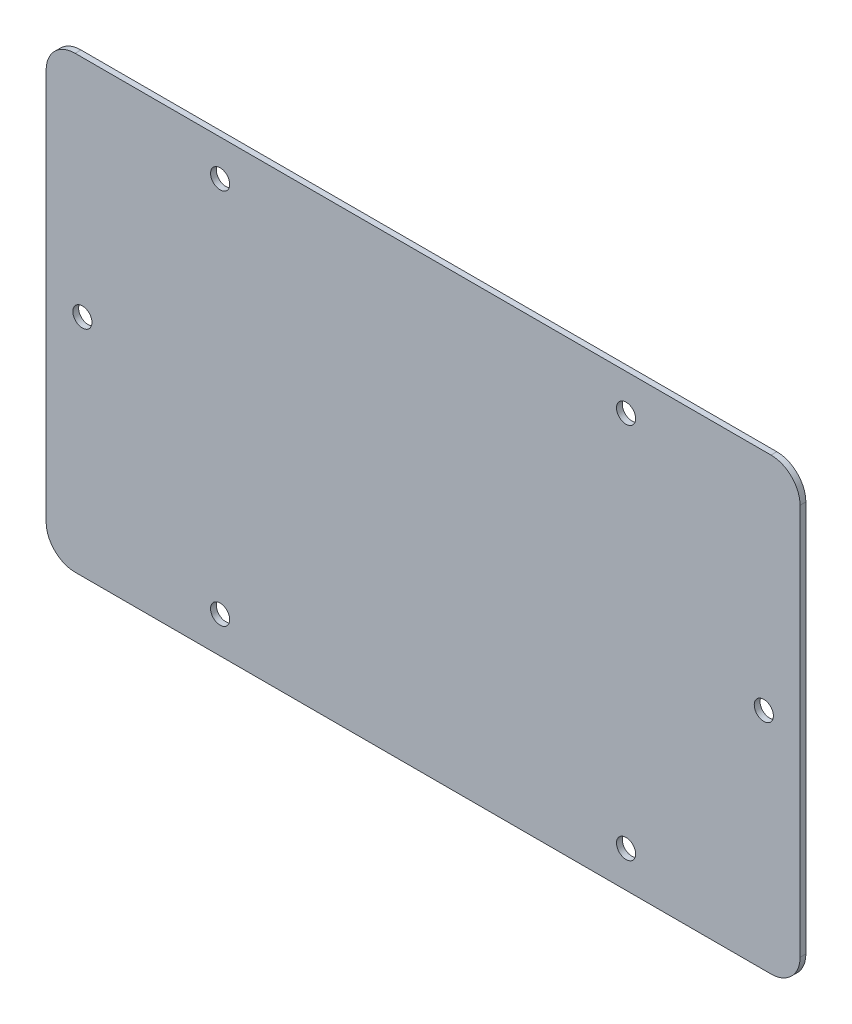
ISO-10303-21;
HEADER;
FILE_DESCRIPTION(('STEP AP214'),'2;1');
FILE_NAME('part.step','',(''),(''),'','','');
FILE_SCHEMA(('AUTOMOTIVE_DESIGN { 1 0 10303 214 1 1 1 1 }'));
ENDSEC;
DATA;
#1=APPLICATION_CONTEXT('core data for automotive mechanical design processes');
#2=APPLICATION_PROTOCOL_DEFINITION('international standard','automotive_design',2000,#1);
#3=PRODUCT_CONTEXT('',#1,'mechanical');
#4=PRODUCT('Part','Part','',(#3));
#5=PRODUCT_RELATED_PRODUCT_CATEGORY('part','',(#4));
#6=PRODUCT_DEFINITION_FORMATION('','',#4);
#7=PRODUCT_DEFINITION_CONTEXT('part definition',#1,'design');
#8=PRODUCT_DEFINITION('design','',#6,#7);
#9=PRODUCT_DEFINITION_SHAPE('','',#8);
#10=(LENGTH_UNIT() NAMED_UNIT(*) SI_UNIT(.MILLI.,.METRE.));
#11=(NAMED_UNIT(*) PLANE_ANGLE_UNIT() SI_UNIT($,.RADIAN.));
#12=(NAMED_UNIT(*) SI_UNIT($,.STERADIAN.) SOLID_ANGLE_UNIT());
#13=UNCERTAINTY_MEASURE_WITH_UNIT(LENGTH_MEASURE(1.E-05),#10,'distance_accuracy_value','');
#14=(GEOMETRIC_REPRESENTATION_CONTEXT(3) GLOBAL_UNCERTAINTY_ASSIGNED_CONTEXT((#13)) GLOBAL_UNIT_ASSIGNED_CONTEXT((#10,
#11,#12)) REPRESENTATION_CONTEXT('',''));
#15=CARTESIAN_POINT('',(0.,0.,0.));
#16=DIRECTION('',(0.,0.,1.));
#17=DIRECTION('',(1.,0.,0.));
#18=AXIS2_PLACEMENT_3D('',#15,#16,#17);
#19=CARTESIAN_POINT('',(-130.,77.5,0.));
#20=DIRECTION('',(0.,-1.,0.));
#21=DIRECTION('',(-1.,0.,0.));
#22=AXIS2_PLACEMENT_3D('',#19,#20,#21);
#23=PLANE('',#22);
#24=DIRECTION('',(0.,0.,1.));
#25=VECTOR('',#24,1.);
#26=CARTESIAN_POINT('',(120.,77.5,0.));
#27=LINE('',#26,#25);
#28=CARTESIAN_POINT('',(120.,77.5,-2.));
#29=VERTEX_POINT('',#28);
#30=CARTESIAN_POINT('',(120.,77.5,0.));
#31=VERTEX_POINT('',#30);
#32=EDGE_CURVE('E11',#29,#31,#27,.T.);
#33=ORIENTED_EDGE('',*,*,#32,.F.);
#34=DIRECTION('',(-1.,0.,0.));
#35=VECTOR('',#34,1.);
#36=CARTESIAN_POINT('',(0.,77.5,-2.));
#37=LINE('',#36,#35);
#38=CARTESIAN_POINT('',(-120.,77.5,-2.));
#39=VERTEX_POINT('',#38);
#40=EDGE_CURVE('E104',#29,#39,#37,.T.);
#41=ORIENTED_EDGE('',*,*,#40,.T.);
#42=DIRECTION('',(0.,0.,1.));
#43=VECTOR('',#42,1.);
#44=CARTESIAN_POINT('',(-120.,77.5,0.));
#45=LINE('',#44,#43);
#46=CARTESIAN_POINT('',(-120.,77.5,0.));
#47=VERTEX_POINT('',#46);
#48=EDGE_CURVE('E47',#39,#47,#45,.T.);
#49=ORIENTED_EDGE('',*,*,#48,.T.);
#50=DIRECTION('',(-1.,0.,0.));
#51=VECTOR('',#50,1.);
#52=CARTESIAN_POINT('',(-130.,77.5,0.));
#53=LINE('',#52,#51);
#54=EDGE_CURVE('E146',#31,#47,#53,.T.);
#55=ORIENTED_EDGE('',*,*,#54,.F.);
#56=EDGE_LOOP('',(#33,#41,#49,#55));
#57=FACE_BOUND('',#56,.T.);
#58=ADVANCED_FACE('F37',(#57),#23,.F.);
#59=CARTESIAN_POINT('',(-120.,67.5,0.));
#60=DIRECTION('',(0.,0.,-1.));
#61=DIRECTION('',(-1.,0.,0.));
#62=AXIS2_PLACEMENT_3D('',#59,#60,#61);
#63=CYLINDRICAL_SURFACE('',#62,10.);
#64=ORIENTED_EDGE('',*,*,#48,.F.);
#65=CARTESIAN_POINT('',(-120.,67.5,-2.));
#66=DIRECTION('',(0.,0.,-1.));
#67=DIRECTION('',(-1.,0.,0.));
#68=AXIS2_PLACEMENT_3D('',#65,#66,#67);
#69=CIRCLE('',#68,10.);
#70=CARTESIAN_POINT('',(-130.,67.5,-2.));
#71=VERTEX_POINT('',#70);
#72=EDGE_CURVE('E126',#39,#71,#69,.F.);
#73=ORIENTED_EDGE('',*,*,#72,.T.);
#74=DIRECTION('',(0.,0.,1.));
#75=VECTOR('',#74,1.);
#76=CARTESIAN_POINT('',(-130.,67.5,0.));
#77=LINE('',#76,#75);
#78=CARTESIAN_POINT('',(-130.,67.5,0.));
#79=VERTEX_POINT('',#78);
#80=EDGE_CURVE('E139',#71,#79,#77,.T.);
#81=ORIENTED_EDGE('',*,*,#80,.T.);
#82=CARTESIAN_POINT('',(-120.,67.5,0.));
#83=DIRECTION('',(0.,0.,-1.));
#84=DIRECTION('',(-1.,0.,0.));
#85=AXIS2_PLACEMENT_3D('',#82,#83,#84);
#86=CIRCLE('',#85,10.);
#87=EDGE_CURVE('E155',#47,#79,#86,.F.);
#88=ORIENTED_EDGE('',*,*,#87,.F.);
#89=EDGE_LOOP('',(#64,#73,#81,#88));
#90=FACE_BOUND('',#89,.T.);
#91=ADVANCED_FACE('F158',(#90),#63,.T.);
#92=CARTESIAN_POINT('',(-130.,-77.5000000000001,0.));
#93=DIRECTION('',(1.,0.,0.));
#94=DIRECTION('',(0.,-1.,0.));
#95=AXIS2_PLACEMENT_3D('',#92,#93,#94);
#96=PLANE('',#95);
#97=ORIENTED_EDGE('',*,*,#80,.F.);
#98=DIRECTION('',(0.,1.,0.));
#99=VECTOR('',#98,1.);
#100=CARTESIAN_POINT('',(-130.,0.,-2.));
#101=LINE('',#100,#99);
#102=CARTESIAN_POINT('',(-130.,-67.5000000000001,-2.));
#103=VERTEX_POINT('',#102);
#104=EDGE_CURVE('E123',#71,#103,#101,.F.);
#105=ORIENTED_EDGE('',*,*,#104,.T.);
#106=DIRECTION('',(0.,0.,1.));
#107=VECTOR('',#106,1.);
#108=CARTESIAN_POINT('',(-130.,-67.5000000000001,0.));
#109=LINE('',#108,#107);
#110=CARTESIAN_POINT('',(-130.,-67.5000000000001,0.));
#111=VERTEX_POINT('',#110);
#112=EDGE_CURVE('E136',#103,#111,#109,.T.);
#113=ORIENTED_EDGE('',*,*,#112,.T.);
#114=DIRECTION('',(0.,-1.,0.));
#115=VECTOR('',#114,1.);
#116=CARTESIAN_POINT('',(-130.,-77.5000000000001,0.));
#117=LINE('',#116,#115);
#118=EDGE_CURVE('E159',#79,#111,#117,.T.);
#119=ORIENTED_EDGE('',*,*,#118,.F.);
#120=EDGE_LOOP('',(#97,#105,#113,#119));
#121=FACE_BOUND('',#120,.T.);
#122=ADVANCED_FACE('F212',(#121),#96,.F.);
#123=CARTESIAN_POINT('',(-120.,-67.5000000000001,0.));
#124=DIRECTION('',(0.,0.,-1.));
#125=DIRECTION('',(-1.,0.,0.));
#126=AXIS2_PLACEMENT_3D('',#123,#124,#125);
#127=CYLINDRICAL_SURFACE('',#126,10.);
#128=ORIENTED_EDGE('',*,*,#112,.F.);
#129=CARTESIAN_POINT('',(-120.,-67.5000000000001,-2.));
#130=DIRECTION('',(0.,0.,-1.));
#131=DIRECTION('',(-1.,0.,0.));
#132=AXIS2_PLACEMENT_3D('',#129,#130,#131);
#133=CIRCLE('',#132,10.);
#134=CARTESIAN_POINT('',(-120.,-77.5000000000001,-2.));
#135=VERTEX_POINT('',#134);
#136=EDGE_CURVE('E120',#103,#135,#133,.F.);
#137=ORIENTED_EDGE('',*,*,#136,.T.);
#138=DIRECTION('',(0.,0.,1.));
#139=VECTOR('',#138,1.);
#140=CARTESIAN_POINT('',(-120.,-77.5000000000001,0.));
#141=LINE('',#140,#139);
#142=CARTESIAN_POINT('',(-120.,-77.5000000000001,0.));
#143=VERTEX_POINT('',#142);
#144=EDGE_CURVE('E133',#135,#143,#141,.T.);
#145=ORIENTED_EDGE('',*,*,#144,.T.);
#146=CARTESIAN_POINT('',(-120.,-67.5000000000001,0.));
#147=DIRECTION('',(0.,0.,-1.));
#148=DIRECTION('',(-1.,0.,0.));
#149=AXIS2_PLACEMENT_3D('',#146,#147,#148);
#150=CIRCLE('',#149,10.);
#151=EDGE_CURVE('E161',#111,#143,#150,.F.);
#152=ORIENTED_EDGE('',*,*,#151,.F.);
#153=EDGE_LOOP('',(#128,#137,#145,#152));
#154=FACE_BOUND('',#153,.T.);
#155=ADVANCED_FACE('F217',(#154),#127,.T.);
#156=CARTESIAN_POINT('',(-130.,-77.5000000000001,0.));
#157=DIRECTION('',(0.,1.,0.));
#158=DIRECTION('',(1.,0.,0.));
#159=AXIS2_PLACEMENT_3D('',#156,#157,#158);
#160=PLANE('',#159);
#161=ORIENTED_EDGE('',*,*,#144,.F.);
#162=DIRECTION('',(-1.,0.,0.));
#163=VECTOR('',#162,1.);
#164=CARTESIAN_POINT('',(0.,-77.5000000000001,-2.));
#165=LINE('',#164,#163);
#166=CARTESIAN_POINT('',(120.,-77.5000000000001,-2.));
#167=VERTEX_POINT('',#166);
#168=EDGE_CURVE('E117',#135,#167,#165,.F.);
#169=ORIENTED_EDGE('',*,*,#168,.T.);
#170=DIRECTION('',(0.,0.,1.));
#171=VECTOR('',#170,1.);
#172=CARTESIAN_POINT('',(120.,-77.5000000000001,0.));
#173=LINE('',#172,#171);
#174=CARTESIAN_POINT('',(120.,-77.5000000000001,0.));
#175=VERTEX_POINT('',#174);
#176=EDGE_CURVE('E131',#167,#175,#173,.T.);
#177=ORIENTED_EDGE('',*,*,#176,.T.);
#178=DIRECTION('',(1.,0.,0.));
#179=VECTOR('',#178,1.);
#180=CARTESIAN_POINT('',(-130.,-77.5000000000001,0.));
#181=LINE('',#180,#179);
#182=EDGE_CURVE('E167',#143,#175,#181,.T.);
#183=ORIENTED_EDGE('',*,*,#182,.F.);
#184=EDGE_LOOP('',(#161,#169,#177,#183));
#185=FACE_BOUND('',#184,.T.);
#186=ADVANCED_FACE('F221',(#185),#160,.F.);
#187=CARTESIAN_POINT('',(120.,-67.5000000000001,0.));
#188=DIRECTION('',(0.,0.,-1.));
#189=DIRECTION('',(-1.,0.,0.));
#190=AXIS2_PLACEMENT_3D('',#187,#188,#189);
#191=CYLINDRICAL_SURFACE('',#190,10.);
#192=ORIENTED_EDGE('',*,*,#176,.F.);
#193=CARTESIAN_POINT('',(120.,-67.5000000000001,-2.));
#194=DIRECTION('',(0.,0.,-1.));
#195=DIRECTION('',(-1.,0.,0.));
#196=AXIS2_PLACEMENT_3D('',#193,#194,#195);
#197=CIRCLE('',#196,10.);
#198=CARTESIAN_POINT('',(130.,-67.5000000000001,-2.));
#199=VERTEX_POINT('',#198);
#200=EDGE_CURVE('E114',#167,#199,#197,.F.);
#201=ORIENTED_EDGE('',*,*,#200,.T.);
#202=DIRECTION('',(0.,0.,1.));
#203=VECTOR('',#202,1.);
#204=CARTESIAN_POINT('',(130.,-67.5000000000001,0.));
#205=LINE('',#204,#203);
#206=CARTESIAN_POINT('',(130.,-67.5000000000001,0.));
#207=VERTEX_POINT('',#206);
#208=EDGE_CURVE('E55',#199,#207,#205,.T.);
#209=ORIENTED_EDGE('',*,*,#208,.T.);
#210=CARTESIAN_POINT('',(120.,-67.5000000000001,0.));
#211=DIRECTION('',(0.,0.,-1.));
#212=DIRECTION('',(-1.,0.,0.));
#213=AXIS2_PLACEMENT_3D('',#210,#211,#212);
#214=CIRCLE('',#213,10.);
#215=EDGE_CURVE('E97',#175,#207,#214,.F.);
#216=ORIENTED_EDGE('',*,*,#215,.F.);
#217=EDGE_LOOP('',(#192,#201,#209,#216));
#218=FACE_BOUND('',#217,.T.);
#219=ADVANCED_FACE('F225',(#218),#191,.T.);
#220=CARTESIAN_POINT('',(130.,-77.5000000000001,0.));
#221=DIRECTION('',(-1.,0.,0.));
#222=DIRECTION('',(0.,1.,0.));
#223=AXIS2_PLACEMENT_3D('',#220,#221,#222);
#224=PLANE('',#223);
#225=ORIENTED_EDGE('',*,*,#208,.F.);
#226=DIRECTION('',(0.,1.,0.));
#227=VECTOR('',#226,1.);
#228=CARTESIAN_POINT('',(130.,0.,-2.));
#229=LINE('',#228,#227);
#230=CARTESIAN_POINT('',(130.,67.5,-2.));
#231=VERTEX_POINT('',#230);
#232=EDGE_CURVE('E102',#199,#231,#229,.T.);
#233=ORIENTED_EDGE('',*,*,#232,.T.);
#234=DIRECTION('',(0.,0.,1.));
#235=VECTOR('',#234,1.);
#236=CARTESIAN_POINT('',(130.,67.5,0.));
#237=LINE('',#236,#235);
#238=CARTESIAN_POINT('',(130.,67.5,0.));
#239=VERTEX_POINT('',#238);
#240=EDGE_CURVE('E41',#231,#239,#237,.T.);
#241=ORIENTED_EDGE('',*,*,#240,.T.);
#242=DIRECTION('',(0.,1.,0.));
#243=VECTOR('',#242,1.);
#244=CARTESIAN_POINT('',(130.,-77.5000000000001,0.));
#245=LINE('',#244,#243);
#246=EDGE_CURVE('E273',#207,#239,#245,.T.);
#247=ORIENTED_EDGE('',*,*,#246,.F.);
#248=EDGE_LOOP('',(#225,#233,#241,#247));
#249=FACE_BOUND('',#248,.T.);
#250=ADVANCED_FACE('F106',(#249),#224,.F.);
#251=CARTESIAN_POINT('',(70.0000000000001,65.,0.));
#252=DIRECTION('',(0.,0.,-1.));
#253=DIRECTION('',(-1.,0.,0.));
#254=AXIS2_PLACEMENT_3D('',#251,#252,#253);
#255=CYLINDRICAL_SURFACE('',#254,3.3);
#256=CARTESIAN_POINT('',(70.0000000000001,65.,0.));
#257=DIRECTION('',(0.,0.,-1.));
#258=DIRECTION('',(-1.,0.,0.));
#259=AXIS2_PLACEMENT_3D('',#256,#257,#258);
#260=CIRCLE('',#259,3.3);
#261=CARTESIAN_POINT('',(66.7000000000001,65.,0.));
#262=VERTEX_POINT('',#261);
#263=EDGE_CURVE('E116',#262,#262,#260,.T.);
#264=ORIENTED_EDGE('',*,*,#263,.F.);
#265=EDGE_LOOP('',(#264));
#266=FACE_BOUND('',#265,.T.);
#267=CARTESIAN_POINT('',(70.0000000000001,65.,-2.));
#268=DIRECTION('',(0.,0.,-1.));
#269=DIRECTION('',(-1.,0.,0.));
#270=AXIS2_PLACEMENT_3D('',#267,#268,#269);
#271=CIRCLE('',#270,3.3);
#272=CARTESIAN_POINT('',(66.7000000000001,65.,-2.));
#273=VERTEX_POINT('',#272);
#274=EDGE_CURVE('E172',#273,#273,#271,.T.);
#275=ORIENTED_EDGE('',*,*,#274,.T.);
#276=EDGE_LOOP('',(#275));
#277=FACE_BOUND('',#276,.T.);
#278=ADVANCED_FACE('F229',(#266,#277),#255,.F.);
#279=CARTESIAN_POINT('',(117.5,0.,0.));
#280=DIRECTION('',(0.,0.,-1.));
#281=DIRECTION('',(-1.,0.,0.));
#282=AXIS2_PLACEMENT_3D('',#279,#280,#281);
#283=CYLINDRICAL_SURFACE('',#282,3.3);
#284=CARTESIAN_POINT('',(117.5,0.,0.));
#285=DIRECTION('',(0.,0.,-1.));
#286=DIRECTION('',(-1.,0.,0.));
#287=AXIS2_PLACEMENT_3D('',#284,#285,#286);
#288=CIRCLE('',#287,3.3);
#289=CARTESIAN_POINT('',(114.2,0.,0.));
#290=VERTEX_POINT('',#289);
#291=EDGE_CURVE('E267',#290,#290,#288,.T.);
#292=ORIENTED_EDGE('',*,*,#291,.F.);
#293=EDGE_LOOP('',(#292));
#294=FACE_BOUND('',#293,.T.);
#295=CARTESIAN_POINT('',(117.5,0.,-2.));
#296=DIRECTION('',(0.,0.,-1.));
#297=DIRECTION('',(-1.,0.,0.));
#298=AXIS2_PLACEMENT_3D('',#295,#296,#297);
#299=CIRCLE('',#298,3.3);
#300=CARTESIAN_POINT('',(114.2,0.,-2.));
#301=VERTEX_POINT('',#300);
#302=EDGE_CURVE('E175',#301,#301,#299,.T.);
#303=ORIENTED_EDGE('',*,*,#302,.T.);
#304=EDGE_LOOP('',(#303));
#305=FACE_BOUND('',#304,.T.);
#306=ADVANCED_FACE('F233',(#294,#305),#283,.F.);
#307=CARTESIAN_POINT('',(70.,-65.,0.));
#308=DIRECTION('',(0.,0.,-1.));
#309=DIRECTION('',(-1.,0.,0.));
#310=AXIS2_PLACEMENT_3D('',#307,#308,#309);
#311=CYLINDRICAL_SURFACE('',#310,3.3);
#312=CARTESIAN_POINT('',(70.,-65.,0.));
#313=DIRECTION('',(0.,0.,-1.));
#314=DIRECTION('',(-1.,0.,0.));
#315=AXIS2_PLACEMENT_3D('',#312,#313,#314);
#316=CIRCLE('',#315,3.3);
#317=CARTESIAN_POINT('',(66.7,-65.,0.));
#318=VERTEX_POINT('',#317);
#319=EDGE_CURVE('E261',#318,#318,#316,.T.);
#320=ORIENTED_EDGE('',*,*,#319,.F.);
#321=EDGE_LOOP('',(#320));
#322=FACE_BOUND('',#321,.T.);
#323=CARTESIAN_POINT('',(70.,-65.,-2.));
#324=DIRECTION('',(0.,0.,-1.));
#325=DIRECTION('',(-1.,0.,0.));
#326=AXIS2_PLACEMENT_3D('',#323,#324,#325);
#327=CIRCLE('',#326,3.3);
#328=CARTESIAN_POINT('',(66.7,-65.,-2.));
#329=VERTEX_POINT('',#328);
#330=EDGE_CURVE('E178',#329,#329,#327,.T.);
#331=ORIENTED_EDGE('',*,*,#330,.T.);
#332=EDGE_LOOP('',(#331));
#333=FACE_BOUND('',#332,.T.);
#334=ADVANCED_FACE('F239',(#322,#333),#311,.F.);
#335=CARTESIAN_POINT('',(-70.,-65.,0.));
#336=DIRECTION('',(0.,0.,-1.));
#337=DIRECTION('',(-1.,0.,0.));
#338=AXIS2_PLACEMENT_3D('',#335,#336,#337);
#339=CYLINDRICAL_SURFACE('',#338,3.3);
#340=CARTESIAN_POINT('',(-70.,-65.,0.));
#341=DIRECTION('',(0.,0.,-1.));
#342=DIRECTION('',(-1.,0.,0.));
#343=AXIS2_PLACEMENT_3D('',#340,#341,#342);
#344=CIRCLE('',#343,3.3);
#345=CARTESIAN_POINT('',(-73.3,-65.,0.));
#346=VERTEX_POINT('',#345);
#347=EDGE_CURVE('E256',#346,#346,#344,.T.);
#348=ORIENTED_EDGE('',*,*,#347,.F.);
#349=EDGE_LOOP('',(#348));
#350=FACE_BOUND('',#349,.T.);
#351=CARTESIAN_POINT('',(-70.,-65.,-2.));
#352=DIRECTION('',(0.,0.,-1.));
#353=DIRECTION('',(-1.,0.,0.));
#354=AXIS2_PLACEMENT_3D('',#351,#352,#353);
#355=CIRCLE('',#354,3.3);
#356=CARTESIAN_POINT('',(-73.3,-65.,-2.));
#357=VERTEX_POINT('',#356);
#358=EDGE_CURVE('E181',#357,#357,#355,.T.);
#359=ORIENTED_EDGE('',*,*,#358,.T.);
#360=EDGE_LOOP('',(#359));
#361=FACE_BOUND('',#360,.T.);
#362=ADVANCED_FACE('F202',(#350,#361),#339,.F.);
#363=CARTESIAN_POINT('',(-117.5,0.,0.));
#364=DIRECTION('',(0.,0.,-1.));
#365=DIRECTION('',(-1.,0.,0.));
#366=AXIS2_PLACEMENT_3D('',#363,#364,#365);
#367=CYLINDRICAL_SURFACE('',#366,3.3);
#368=CARTESIAN_POINT('',(-117.5,0.,0.));
#369=DIRECTION('',(0.,0.,-1.));
#370=DIRECTION('',(-1.,0.,0.));
#371=AXIS2_PLACEMENT_3D('',#368,#369,#370);
#372=CIRCLE('',#371,3.3);
#373=CARTESIAN_POINT('',(-120.8,0.,0.));
#374=VERTEX_POINT('',#373);
#375=EDGE_CURVE('E260',#374,#374,#372,.T.);
#376=ORIENTED_EDGE('',*,*,#375,.F.);
#377=EDGE_LOOP('',(#376));
#378=FACE_BOUND('',#377,.T.);
#379=CARTESIAN_POINT('',(-117.5,0.,-2.));
#380=DIRECTION('',(0.,0.,-1.));
#381=DIRECTION('',(-1.,0.,0.));
#382=AXIS2_PLACEMENT_3D('',#379,#380,#381);
#383=CIRCLE('',#382,3.3);
#384=CARTESIAN_POINT('',(-120.8,0.,-2.));
#385=VERTEX_POINT('',#384);
#386=EDGE_CURVE('E110',#385,#385,#383,.T.);
#387=ORIENTED_EDGE('',*,*,#386,.T.);
#388=EDGE_LOOP('',(#387));
#389=FACE_BOUND('',#388,.T.);
#390=ADVANCED_FACE('F186',(#378,#389),#367,.F.);
#391=CARTESIAN_POINT('',(-70.,65.,0.));
#392=DIRECTION('',(0.,0.,-1.));
#393=DIRECTION('',(-1.,0.,0.));
#394=AXIS2_PLACEMENT_3D('',#391,#392,#393);
#395=CYLINDRICAL_SURFACE('',#394,3.3);
#396=CARTESIAN_POINT('',(-70.,65.,0.));
#397=DIRECTION('',(0.,0.,-1.));
#398=DIRECTION('',(-1.,0.,0.));
#399=AXIS2_PLACEMENT_3D('',#396,#397,#398);
#400=CIRCLE('',#399,3.3);
#401=CARTESIAN_POINT('',(-73.3,65.,0.));
#402=VERTEX_POINT('',#401);
#403=EDGE_CURVE('E264',#402,#402,#400,.T.);
#404=ORIENTED_EDGE('',*,*,#403,.F.);
#405=EDGE_LOOP('',(#404));
#406=FACE_BOUND('',#405,.T.);
#407=CARTESIAN_POINT('',(-70.,65.,-2.));
#408=DIRECTION('',(0.,0.,-1.));
#409=DIRECTION('',(-1.,0.,0.));
#410=AXIS2_PLACEMENT_3D('',#407,#408,#409);
#411=CIRCLE('',#410,3.3);
#412=CARTESIAN_POINT('',(-73.3,65.,-2.));
#413=VERTEX_POINT('',#412);
#414=EDGE_CURVE('E107',#413,#413,#411,.T.);
#415=ORIENTED_EDGE('',*,*,#414,.T.);
#416=EDGE_LOOP('',(#415));
#417=FACE_BOUND('',#416,.T.);
#418=ADVANCED_FACE('F194',(#406,#417),#395,.F.);
#419=CARTESIAN_POINT('',(120.,67.5,0.));
#420=DIRECTION('',(0.,0.,-1.));
#421=DIRECTION('',(-1.,0.,0.));
#422=AXIS2_PLACEMENT_3D('',#419,#420,#421);
#423=CYLINDRICAL_SURFACE('',#422,10.);
#424=CARTESIAN_POINT('',(120.,67.5,-2.));
#425=DIRECTION('',(0.,0.,-1.));
#426=DIRECTION('',(-1.,0.,0.));
#427=AXIS2_PLACEMENT_3D('',#424,#425,#426);
#428=CIRCLE('',#427,10.);
#429=EDGE_CURVE('E91',#231,#29,#428,.F.);
#430=ORIENTED_EDGE('',*,*,#429,.T.);
#431=ORIENTED_EDGE('',*,*,#32,.T.);
#432=CARTESIAN_POINT('',(120.,67.5,0.));
#433=DIRECTION('',(0.,0.,-1.));
#434=DIRECTION('',(-1.,0.,0.));
#435=AXIS2_PLACEMENT_3D('',#432,#433,#434);
#436=CIRCLE('',#435,10.);
#437=EDGE_CURVE('E93',#239,#31,#436,.F.);
#438=ORIENTED_EDGE('',*,*,#437,.F.);
#439=ORIENTED_EDGE('',*,*,#240,.F.);
#440=EDGE_LOOP('',(#430,#431,#438,#439));
#441=FACE_BOUND('',#440,.T.);
#442=ADVANCED_FACE('F39',(#441),#423,.T.);
#443=CARTESIAN_POINT('',(0.,0.,0.));
#444=DIRECTION('',(0.,0.,-1.));
#445=DIRECTION('',(-1.,0.,0.));
#446=AXIS2_PLACEMENT_3D('',#443,#444,#445);
#447=PLANE('',#446);
#448=ORIENTED_EDGE('',*,*,#263,.T.);
#449=EDGE_LOOP('',(#448));
#450=FACE_BOUND('',#449,.T.);
#451=ORIENTED_EDGE('',*,*,#291,.T.);
#452=EDGE_LOOP('',(#451));
#453=FACE_BOUND('',#452,.T.);
#454=ORIENTED_EDGE('',*,*,#319,.T.);
#455=EDGE_LOOP('',(#454));
#456=FACE_BOUND('',#455,.T.);
#457=ORIENTED_EDGE('',*,*,#347,.T.);
#458=EDGE_LOOP('',(#457));
#459=FACE_BOUND('',#458,.T.);
#460=ORIENTED_EDGE('',*,*,#375,.T.);
#461=EDGE_LOOP('',(#460));
#462=FACE_BOUND('',#461,.T.);
#463=ORIENTED_EDGE('',*,*,#403,.T.);
#464=EDGE_LOOP('',(#463));
#465=FACE_BOUND('',#464,.T.);
#466=ORIENTED_EDGE('',*,*,#246,.T.);
#467=ORIENTED_EDGE('',*,*,#437,.T.);
#468=ORIENTED_EDGE('',*,*,#54,.T.);
#469=ORIENTED_EDGE('',*,*,#87,.T.);
#470=ORIENTED_EDGE('',*,*,#118,.T.);
#471=ORIENTED_EDGE('',*,*,#151,.T.);
#472=ORIENTED_EDGE('',*,*,#182,.T.);
#473=ORIENTED_EDGE('',*,*,#215,.T.);
#474=EDGE_LOOP('',(#466,#467,#468,#469,#470,#471,#472,#473));
#475=FACE_BOUND('',#474,.T.);
#476=ADVANCED_FACE('F153',(#450,#453,#456,#459,#462,#465,#475),#447,.F.);
#477=CARTESIAN_POINT('',(0.,0.,-2.));
#478=DIRECTION('',(0.,0.,-1.));
#479=DIRECTION('',(-1.,0.,0.));
#480=AXIS2_PLACEMENT_3D('',#477,#478,#479);
#481=PLANE('',#480);
#482=ORIENTED_EDGE('',*,*,#274,.F.);
#483=EDGE_LOOP('',(#482));
#484=FACE_BOUND('',#483,.T.);
#485=ORIENTED_EDGE('',*,*,#302,.F.);
#486=EDGE_LOOP('',(#485));
#487=FACE_BOUND('',#486,.T.);
#488=ORIENTED_EDGE('',*,*,#330,.F.);
#489=EDGE_LOOP('',(#488));
#490=FACE_BOUND('',#489,.T.);
#491=ORIENTED_EDGE('',*,*,#358,.F.);
#492=EDGE_LOOP('',(#491));
#493=FACE_BOUND('',#492,.T.);
#494=ORIENTED_EDGE('',*,*,#386,.F.);
#495=EDGE_LOOP('',(#494));
#496=FACE_BOUND('',#495,.T.);
#497=ORIENTED_EDGE('',*,*,#414,.F.);
#498=EDGE_LOOP('',(#497));
#499=FACE_BOUND('',#498,.T.);
#500=ORIENTED_EDGE('',*,*,#232,.F.);
#501=ORIENTED_EDGE('',*,*,#200,.F.);
#502=ORIENTED_EDGE('',*,*,#168,.F.);
#503=ORIENTED_EDGE('',*,*,#136,.F.);
#504=ORIENTED_EDGE('',*,*,#104,.F.);
#505=ORIENTED_EDGE('',*,*,#72,.F.);
#506=ORIENTED_EDGE('',*,*,#40,.F.);
#507=ORIENTED_EDGE('',*,*,#429,.F.);
#508=EDGE_LOOP('',(#500,#501,#502,#503,#504,#505,#506,#507));
#509=FACE_BOUND('',#508,.T.);
#510=ADVANCED_FACE('F100',(#484,#487,#490,#493,#496,#499,#509),#481,.T.);
#511=CLOSED_SHELL('',(#58,#91,#122,#155,#186,#219,#250,#278,#306,#334,#362,#390,#418,#442,#476,#510));
#512=MANIFOLD_SOLID_BREP('B2',#511);
#513=ADVANCED_BREP_SHAPE_REPRESENTATION('',(#18,#512),#14);
#514=SHAPE_DEFINITION_REPRESENTATION(#9,#513);
ENDSEC;
END-ISO-10303-21;
